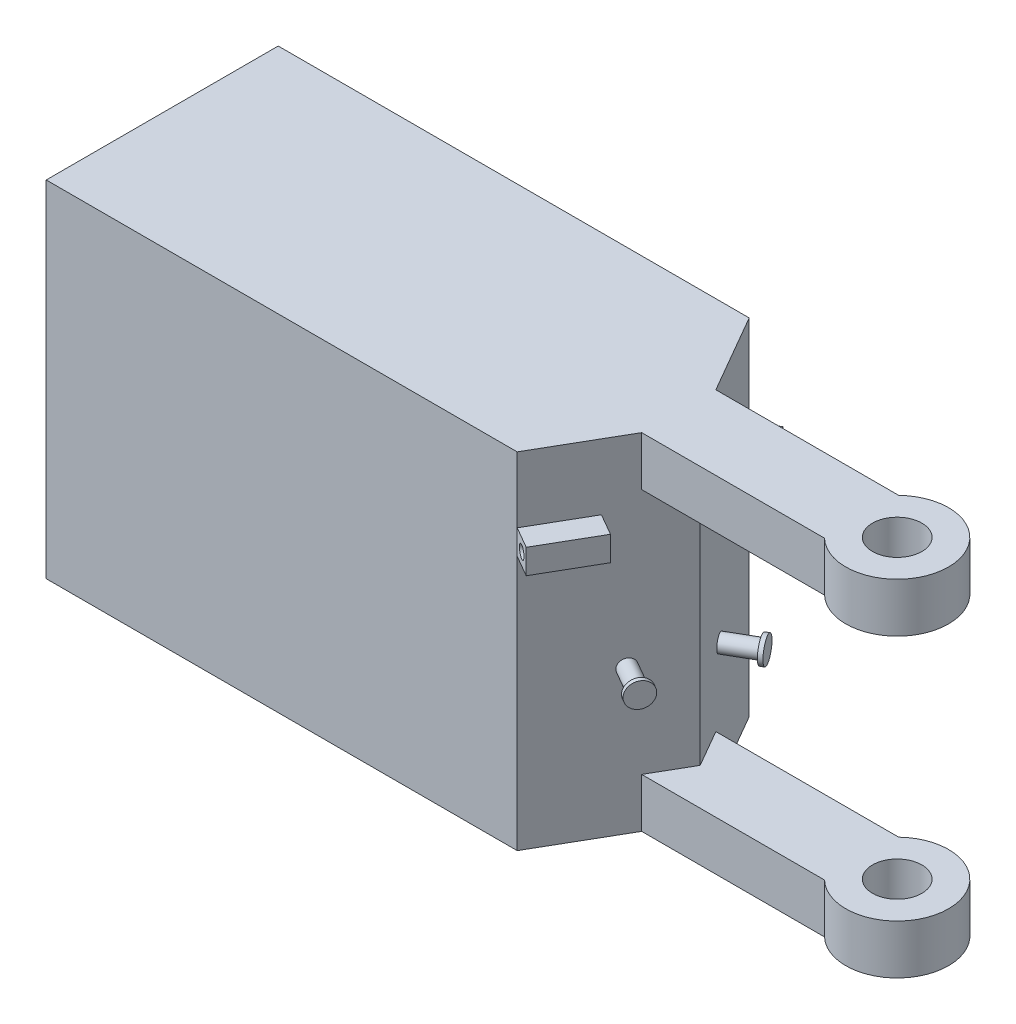
ISO-10303-21;
HEADER;
FILE_DESCRIPTION(('STEP AP214'),'2;1');
FILE_NAME('part.step','',(''),(''),'','','');
FILE_SCHEMA(('AUTOMOTIVE_DESIGN { 1 0 10303 214 1 1 1 1 }'));
ENDSEC;
DATA;
#1=APPLICATION_CONTEXT('core data for automotive mechanical design processes');
#2=APPLICATION_PROTOCOL_DEFINITION('international standard','automotive_design',2000,#1);
#3=PRODUCT_CONTEXT('',#1,'mechanical');
#4=PRODUCT('Part','Part','',(#3));
#5=PRODUCT_RELATED_PRODUCT_CATEGORY('part','',(#4));
#6=PRODUCT_DEFINITION_FORMATION('','',#4);
#7=PRODUCT_DEFINITION_CONTEXT('part definition',#1,'design');
#8=PRODUCT_DEFINITION('design','',#6,#7);
#9=PRODUCT_DEFINITION_SHAPE('','',#8);
#10=(LENGTH_UNIT() NAMED_UNIT(*) SI_UNIT(.MILLI.,.METRE.));
#11=(NAMED_UNIT(*) PLANE_ANGLE_UNIT() SI_UNIT($,.RADIAN.));
#12=(NAMED_UNIT(*) SI_UNIT($,.STERADIAN.) SOLID_ANGLE_UNIT());
#13=UNCERTAINTY_MEASURE_WITH_UNIT(LENGTH_MEASURE(1.E-05),#10,'distance_accuracy_value','');
#14=(GEOMETRIC_REPRESENTATION_CONTEXT(3) GLOBAL_UNCERTAINTY_ASSIGNED_CONTEXT((#13)) GLOBAL_UNIT_ASSIGNED_CONTEXT((#10,
#11,#12)) REPRESENTATION_CONTEXT('',''));
#15=CARTESIAN_POINT('',(0.,0.,0.));
#16=DIRECTION('',(0.,0.,1.));
#17=DIRECTION('',(1.,0.,0.));
#18=AXIS2_PLACEMENT_3D('',#15,#16,#17);
#19=CARTESIAN_POINT('',(131.699506883893,35.,15.5213300029047));
#20=DIRECTION('',(-0.86602540378444,0.,-0.499999999999998));
#21=DIRECTION('',(-0.499999999999997,0.,0.86602540378444));
#22=AXIS2_PLACEMENT_3D('',#19,#20,#21);
#23=CYLINDRICAL_SURFACE('',#22,2.);
#24=CARTESIAN_POINT('',(124.338290951725,35.,11.2713300029047));
#25=DIRECTION('',(-0.86602540378444,0.,-0.499999999999997));
#26=DIRECTION('',(-0.499999999999997,0.,0.86602540378444));
#27=AXIS2_PLACEMENT_3D('',#24,#25,#26);
#28=CIRCLE('',#27,2.);
#29=CARTESIAN_POINT('',(123.338290951725,35.,13.0033808104736));
#30=VERTEX_POINT('',#29);
#31=EDGE_CURVE('E296',#30,#30,#28,.F.);
#32=ORIENTED_EDGE('',*,*,#31,.T.);
#33=EDGE_LOOP('',(#32));
#34=FACE_BOUND('',#33,.T.);
#35=CARTESIAN_POINT('',(130.833481480108,35.,15.0213300029047));
#36=DIRECTION('',(0.86602540378444,0.,0.499999999999997));
#37=DIRECTION('',(0.499999999999997,0.,-0.86602540378444));
#38=AXIS2_PLACEMENT_3D('',#35,#36,#37);
#39=CIRCLE('',#38,2.);
#40=CARTESIAN_POINT('',(131.833481480108,35.,13.2892791953358));
#41=VERTEX_POINT('',#40);
#42=EDGE_CURVE('E11',#41,#41,#39,.T.);
#43=ORIENTED_EDGE('',*,*,#42,.F.);
#44=EDGE_LOOP('',(#43));
#45=FACE_BOUND('',#44,.T.);
#46=ADVANCED_FACE('F37',(#34,#45),#23,.T.);
#47=CARTESIAN_POINT('',(131.699506883893,29.,-15.5213300029046));
#48=DIRECTION('',(-0.86602540378444,0.,0.499999999999998));
#49=DIRECTION('',(0.499999999999997,0.,0.86602540378444));
#50=AXIS2_PLACEMENT_3D('',#47,#48,#49);
#51=CYLINDRICAL_SURFACE('',#50,2.);
#52=CARTESIAN_POINT('',(124.338290951725,29.,-11.2713300029047));
#53=DIRECTION('',(0.86602540378444,0.,-0.499999999999997));
#54=DIRECTION('',(-0.499999999999998,0.,-0.86602540378444));
#55=AXIS2_PLACEMENT_3D('',#52,#53,#54);
#56=CIRCLE('',#55,2.);
#57=CARTESIAN_POINT('',(123.338290951725,29.,-13.0033808104735));
#58=VERTEX_POINT('',#57);
#59=EDGE_CURVE('E237',#58,#58,#56,.T.);
#60=ORIENTED_EDGE('',*,*,#59,.T.);
#61=EDGE_LOOP('',(#60));
#62=FACE_BOUND('',#61,.T.);
#63=CARTESIAN_POINT('',(130.833481480108,29.,-15.0213300029047));
#64=DIRECTION('',(0.86602540378444,0.,-0.499999999999997));
#65=DIRECTION('',(-0.499999999999997,0.,-0.86602540378444));
#66=AXIS2_PLACEMENT_3D('',#63,#64,#65);
#67=CIRCLE('',#66,2.);
#68=CARTESIAN_POINT('',(129.833481480108,29.,-16.7533808104736));
#69=VERTEX_POINT('',#68);
#70=EDGE_CURVE('E45',#69,#69,#67,.T.);
#71=ORIENTED_EDGE('',*,*,#70,.F.);
#72=EDGE_LOOP('',(#71));
#73=FACE_BOUND('',#72,.T.);
#74=ADVANCED_FACE('F367',(#62,#73),#51,.T.);
#75=CARTESIAN_POINT('',(98.1343472722705,12.,56.6578918143932));
#76=DIRECTION('',(-0.86602540378444,0.,-0.499999999999997));
#77=DIRECTION('',(-0.499999999999997,0.,0.86602540378444));
#78=AXIS2_PLACEMENT_3D('',#75,#76,#77);
#79=PLANE('',#78);
#80=ORIENTED_EDGE('',*,*,#31,.F.);
#81=EDGE_LOOP('',(#80));
#82=FACE_BOUND('',#81,.T.);
#83=DIRECTION('',(0.499999999999998,0.,-0.86602540378444));
#84=VECTOR('',#83,1.);
#85=CARTESIAN_POINT('',(122.056109317579,62.,15.2241845453452));
#86=LINE('',#85,#84);
#87=CARTESIAN_POINT('',(114.556109317579,62.,28.2145656021117));
#88=VERTEX_POINT('',#87);
#89=CARTESIAN_POINT('',(122.056109317579,62.,15.2241845453452));
#90=VERTEX_POINT('',#89);
#91=EDGE_CURVE('E471',#88,#90,#86,.T.);
#92=ORIENTED_EDGE('',*,*,#91,.F.);
#93=DIRECTION('',(0.,-1.,0.));
#94=VECTOR('',#93,1.);
#95=CARTESIAN_POINT('',(114.556109317579,12.,28.2145656021117));
#96=LINE('',#95,#94);
#97=CARTESIAN_POINT('',(114.556109317579,0.,28.2145656021117));
#98=VERTEX_POINT('',#97);
#99=EDGE_CURVE('E343',#88,#98,#96,.T.);
#100=ORIENTED_EDGE('',*,*,#99,.T.);
#101=DIRECTION('',(0.499999999999997,0.,-0.86602540378444));
#102=VECTOR('',#101,1.);
#103=CARTESIAN_POINT('',(98.1343472722705,0.,56.6578918143932));
#104=LINE('',#103,#102);
#105=CARTESIAN_POINT('',(125.637290842341,0.,9.02139619333056));
#106=VERTEX_POINT('',#105);
#107=EDGE_CURVE('E337',#98,#106,#104,.T.);
#108=ORIENTED_EDGE('',*,*,#107,.T.);
#109=DIRECTION('',(0.,-1.,0.));
#110=VECTOR('',#109,1.);
#111=CARTESIAN_POINT('',(125.637290842341,12.,9.02139619333056));
#112=LINE('',#111,#110);
#113=CARTESIAN_POINT('',(125.637290842341,12.,9.02139619333056));
#114=VERTEX_POINT('',#113);
#115=EDGE_CURVE('E316',#114,#106,#112,.T.);
#116=ORIENTED_EDGE('',*,*,#115,.F.);
#117=DIRECTION('',(0.500000000000004,0.,-0.866025403784437));
#118=VECTOR('',#117,1.);
#119=CARTESIAN_POINT('',(130.845796363027,12.,2.72351585728359E-13));
#120=LINE('',#119,#118);
#121=CARTESIAN_POINT('',(130.845796363027,12.,2.72351585728359E-13));
#122=VERTEX_POINT('',#121);
#123=EDGE_CURVE('E293',#114,#122,#120,.T.);
#124=ORIENTED_EDGE('',*,*,#123,.T.);
#125=DIRECTION('',(0.,-1.,0.));
#126=VECTOR('',#125,1.);
#127=CARTESIAN_POINT('',(130.845796363027,42.,2.72351585728359E-13));
#128=LINE('',#127,#126);
#129=CARTESIAN_POINT('',(130.845796363027,72.,2.72351585728359E-13));
#130=VERTEX_POINT('',#129);
#131=EDGE_CURVE('E300',#130,#122,#128,.T.);
#132=ORIENTED_EDGE('',*,*,#131,.F.);
#133=DIRECTION('',(0.500000000000004,0.,-0.866025403784437));
#134=VECTOR('',#133,1.);
#135=CARTESIAN_POINT('',(130.845796363027,72.,2.72351585728359E-13));
#136=LINE('',#135,#134);
#137=CARTESIAN_POINT('',(125.637290842341,72.,9.02139619333056));
#138=VERTEX_POINT('',#137);
#139=EDGE_CURVE('E241',#138,#130,#136,.T.);
#140=ORIENTED_EDGE('',*,*,#139,.F.);
#141=DIRECTION('',(0.,1.,0.));
#142=VECTOR('',#141,1.);
#143=CARTESIAN_POINT('',(125.637290842341,72.,9.02139619333056));
#144=LINE('',#143,#142);
#145=CARTESIAN_POINT('',(125.637290842341,84.,9.02139619333056));
#146=VERTEX_POINT('',#145);
#147=EDGE_CURVE('E260',#138,#146,#144,.T.);
#148=ORIENTED_EDGE('',*,*,#147,.T.);
#149=DIRECTION('',(0.499999999999997,0.,-0.86602540378444));
#150=VECTOR('',#149,1.);
#151=CARTESIAN_POINT('',(98.1343472722705,84.,56.6578918143932));
#152=LINE('',#151,#150);
#153=CARTESIAN_POINT('',(114.556109317579,84.,28.2145656021117));
#154=VERTEX_POINT('',#153);
#155=EDGE_CURVE('E279',#154,#146,#152,.T.);
#156=ORIENTED_EDGE('',*,*,#155,.F.);
#157=CARTESIAN_POINT('',(114.556109317579,68.,28.2145656021118));
#158=VERTEX_POINT('',#157);
#159=EDGE_CURVE('E344',#154,#158,#96,.T.);
#160=ORIENTED_EDGE('',*,*,#159,.T.);
#161=DIRECTION('',(-0.499999999999998,0.,0.86602540378444));
#162=VECTOR('',#161,1.);
#163=CARTESIAN_POINT('',(114.556109317579,68.,28.2145656021118));
#164=LINE('',#163,#162);
#165=CARTESIAN_POINT('',(122.056109317579,68.,15.2241845453452));
#166=VERTEX_POINT('',#165);
#167=EDGE_CURVE('E57',#166,#158,#164,.T.);
#168=ORIENTED_EDGE('',*,*,#167,.F.);
#169=DIRECTION('',(0.,1.,0.));
#170=VECTOR('',#169,1.);
#171=CARTESIAN_POINT('',(122.056109317579,68.,15.2241845453452));
#172=LINE('',#171,#170);
#173=EDGE_CURVE('E52',#90,#166,#172,.T.);
#174=ORIENTED_EDGE('',*,*,#173,.F.);
#175=EDGE_LOOP('',(#92,#100,#108,#116,#124,#132,#140,#148,#156,#160,#168,#174));
#176=FACE_BOUND('',#175,.T.);
#177=ADVANCED_FACE('F369',(#82,#176),#79,.F.);
#178=CARTESIAN_POINT('',(98.1343472722705,12.,-56.6578918143932));
#179=DIRECTION('',(0.86602540378444,0.,-0.499999999999997));
#180=DIRECTION('',(-0.499999999999997,0.,-0.86602540378444));
#181=AXIS2_PLACEMENT_3D('',#178,#179,#180);
#182=PLANE('',#181);
#183=ORIENTED_EDGE('',*,*,#59,.F.);
#184=EDGE_LOOP('',(#183));
#185=FACE_BOUND('',#184,.T.);
#186=DIRECTION('',(0.,-1.,0.));
#187=VECTOR('',#186,1.);
#188=CARTESIAN_POINT('',(121.104357457631,56.1904414352187,-16.8726671229741));
#189=LINE('',#188,#187);
#190=CARTESIAN_POINT('',(121.104357457631,62.1904414352187,-16.8726671229741));
#191=VERTEX_POINT('',#190);
#192=CARTESIAN_POINT('',(121.104357457631,56.1904414352187,-16.8726671229741));
#193=VERTEX_POINT('',#192);
#194=EDGE_CURVE('E204',#191,#193,#189,.T.);
#195=ORIENTED_EDGE('',*,*,#194,.F.);
#196=DIRECTION('',(0.499999999999997,0.,0.86602540378444));
#197=VECTOR('',#196,1.);
#198=CARTESIAN_POINT('',(121.104357457631,62.1904414352187,-16.8726671229741));
#199=LINE('',#198,#197);
#200=CARTESIAN_POINT('',(114.556109317579,62.1904414352187,-28.2145656021118));
#201=VERTEX_POINT('',#200);
#202=EDGE_CURVE('E202',#201,#191,#199,.T.);
#203=ORIENTED_EDGE('',*,*,#202,.F.);
#204=DIRECTION('',(0.,-1.,0.));
#205=VECTOR('',#204,1.);
#206=CARTESIAN_POINT('',(114.556109317579,12.,-28.2145656021117));
#207=LINE('',#206,#205);
#208=CARTESIAN_POINT('',(114.556109317579,84.,-28.2145656021117));
#209=VERTEX_POINT('',#208);
#210=EDGE_CURVE('E351',#209,#201,#207,.T.);
#211=ORIENTED_EDGE('',*,*,#210,.F.);
#212=DIRECTION('',(0.499999999999997,0.,0.86602540378444));
#213=VECTOR('',#212,1.);
#214=CARTESIAN_POINT('',(98.1343472722705,84.,-56.6578918143932));
#215=LINE('',#214,#213);
#216=CARTESIAN_POINT('',(125.637290842341,84.,-9.02139619333056));
#217=VERTEX_POINT('',#216);
#218=EDGE_CURVE('E268',#209,#217,#215,.T.);
#219=ORIENTED_EDGE('',*,*,#218,.T.);
#220=DIRECTION('',(0.,1.,0.));
#221=VECTOR('',#220,1.);
#222=CARTESIAN_POINT('',(125.637290842341,72.,-9.02139619333056));
#223=LINE('',#222,#221);
#224=CARTESIAN_POINT('',(125.637290842341,72.,-9.02139619333056));
#225=VERTEX_POINT('',#224);
#226=EDGE_CURVE('E285',#225,#217,#223,.T.);
#227=ORIENTED_EDGE('',*,*,#226,.F.);
#228=DIRECTION('',(-0.499999999999997,0.,-0.86602540378444));
#229=VECTOR('',#228,1.);
#230=CARTESIAN_POINT('',(114.556109317579,72.,-28.2145656021117));
#231=LINE('',#230,#229);
#232=EDGE_CURVE('E240',#130,#225,#231,.T.);
#233=ORIENTED_EDGE('',*,*,#232,.F.);
#234=ORIENTED_EDGE('',*,*,#131,.T.);
#235=DIRECTION('',(-0.499999999999997,0.,-0.86602540378444));
#236=VECTOR('',#235,1.);
#237=CARTESIAN_POINT('',(114.556109317579,12.,-28.2145656021117));
#238=LINE('',#237,#236);
#239=CARTESIAN_POINT('',(125.637290842341,12.,-9.02139619333056));
#240=VERTEX_POINT('',#239);
#241=EDGE_CURVE('E244',#122,#240,#238,.T.);
#242=ORIENTED_EDGE('',*,*,#241,.T.);
#243=DIRECTION('',(0.,-1.,0.));
#244=VECTOR('',#243,1.);
#245=CARTESIAN_POINT('',(125.637290842341,12.,-9.02139619333056));
#246=LINE('',#245,#244);
#247=CARTESIAN_POINT('',(125.637290842341,0.,-9.02139619333056));
#248=VERTEX_POINT('',#247);
#249=EDGE_CURVE('E354',#240,#248,#246,.T.);
#250=ORIENTED_EDGE('',*,*,#249,.T.);
#251=DIRECTION('',(0.499999999999997,0.,0.86602540378444));
#252=VECTOR('',#251,1.);
#253=CARTESIAN_POINT('',(98.1343472722705,0.,-56.6578918143932));
#254=LINE('',#253,#252);
#255=CARTESIAN_POINT('',(114.556109317579,0.,-28.2145656021117));
#256=VERTEX_POINT('',#255);
#257=EDGE_CURVE('E325',#256,#248,#254,.T.);
#258=ORIENTED_EDGE('',*,*,#257,.F.);
#259=CARTESIAN_POINT('',(114.556109317579,56.1904414352186,-28.2145656021117));
#260=VERTEX_POINT('',#259);
#261=EDGE_CURVE('E350',#260,#256,#207,.T.);
#262=ORIENTED_EDGE('',*,*,#261,.F.);
#263=DIRECTION('',(-0.499999999999997,0.,-0.86602540378444));
#264=VECTOR('',#263,1.);
#265=CARTESIAN_POINT('',(114.556109317579,56.1904414352187,-28.2145656021118));
#266=LINE('',#265,#264);
#267=EDGE_CURVE('E223',#193,#260,#266,.T.);
#268=ORIENTED_EDGE('',*,*,#267,.F.);
#269=EDGE_LOOP('',(#195,#203,#211,#219,#227,#233,#234,#242,#250,#258,#262,#268));
#270=FACE_BOUND('',#269,.T.);
#271=ADVANCED_FACE('F376',(#185,#270),#182,.T.);
#272=CARTESIAN_POINT('',(0.,12.,9.02139619333056));
#273=DIRECTION('',(0.,0.,-1.));
#274=DIRECTION('',(-1.,0.,0.));
#275=AXIS2_PLACEMENT_3D('',#272,#273,#274);
#276=PLANE('',#275);
#277=DIRECTION('',(1.,0.,0.));
#278=VECTOR('',#277,1.);
#279=CARTESIAN_POINT('',(0.,0.,9.02139619333056));
#280=LINE('',#279,#278);
#281=CARTESIAN_POINT('',(170.113446459772,0.,9.02139619333057));
#282=VERTEX_POINT('',#281);
#283=EDGE_CURVE('E303',#106,#282,#280,.T.);
#284=ORIENTED_EDGE('',*,*,#283,.T.);
#285=DIRECTION('',(0.,-1.,0.));
#286=VECTOR('',#285,1.);
#287=CARTESIAN_POINT('',(170.113446459772,12.,9.02139619333057));
#288=LINE('',#287,#286);
#289=CARTESIAN_POINT('',(170.113446459772,12.,9.02139619333057));
#290=VERTEX_POINT('',#289);
#291=EDGE_CURVE('E297',#290,#282,#288,.T.);
#292=ORIENTED_EDGE('',*,*,#291,.F.);
#293=DIRECTION('',(1.,0.,0.));
#294=VECTOR('',#293,1.);
#295=CARTESIAN_POINT('',(0.,12.,9.02139619333056));
#296=LINE('',#295,#294);
#297=EDGE_CURVE('E304',#114,#290,#296,.T.);
#298=ORIENTED_EDGE('',*,*,#297,.F.);
#299=ORIENTED_EDGE('',*,*,#115,.T.);
#300=EDGE_LOOP('',(#284,#292,#298,#299));
#301=FACE_BOUND('',#300,.T.);
#302=ADVANCED_FACE('F39',(#301),#276,.F.);
#303=CARTESIAN_POINT('',(178.765868705766,12.,0.));
#304=DIRECTION('',(0.,-1.,0.));
#305=DIRECTION('',(0.,0.,-1.));
#306=AXIS2_PLACEMENT_3D('',#303,#304,#305);
#307=CYLINDRICAL_SURFACE('',#306,12.5);
#308=CARTESIAN_POINT('',(178.765868705766,0.,0.));
#309=DIRECTION('',(0.,1.,0.));
#310=DIRECTION('',(0.,0.,1.));
#311=AXIS2_PLACEMENT_3D('',#308,#309,#310);
#312=CIRCLE('',#311,12.5);
#313=CARTESIAN_POINT('',(170.113446459772,0.,-9.02139619333057));
#314=VERTEX_POINT('',#313);
#315=EDGE_CURVE('E319',#282,#314,#312,.T.);
#316=ORIENTED_EDGE('',*,*,#315,.T.);
#317=DIRECTION('',(0.,-1.,0.));
#318=VECTOR('',#317,1.);
#319=CARTESIAN_POINT('',(170.113446459772,12.,-9.02139619333057));
#320=LINE('',#319,#318);
#321=CARTESIAN_POINT('',(170.113446459772,12.,-9.02139619333057));
#322=VERTEX_POINT('',#321);
#323=EDGE_CURVE('E356',#322,#314,#320,.T.);
#324=ORIENTED_EDGE('',*,*,#323,.F.);
#325=CARTESIAN_POINT('',(178.765868705766,12.,0.));
#326=DIRECTION('',(0.,1.,0.));
#327=DIRECTION('',(0.,0.,1.));
#328=AXIS2_PLACEMENT_3D('',#325,#326,#327);
#329=CIRCLE('',#328,12.5);
#330=EDGE_CURVE('E307',#290,#322,#329,.T.);
#331=ORIENTED_EDGE('',*,*,#330,.F.);
#332=ORIENTED_EDGE('',*,*,#291,.T.);
#333=EDGE_LOOP('',(#316,#324,#331,#332));
#334=FACE_BOUND('',#333,.T.);
#335=ADVANCED_FACE('F438',(#334),#307,.T.);
#336=CARTESIAN_POINT('',(0.,12.,-9.02139619333056));
#337=DIRECTION('',(0.,0.,-1.));
#338=DIRECTION('',(-1.,0.,0.));
#339=AXIS2_PLACEMENT_3D('',#336,#337,#338);
#340=PLANE('',#339);
#341=DIRECTION('',(1.,0.,0.));
#342=VECTOR('',#341,1.);
#343=CARTESIAN_POINT('',(0.,0.,-9.02139619333056));
#344=LINE('',#343,#342);
#345=EDGE_CURVE('E322',#248,#314,#344,.T.);
#346=ORIENTED_EDGE('',*,*,#345,.F.);
#347=ORIENTED_EDGE('',*,*,#249,.F.);
#348=DIRECTION('',(1.,0.,0.));
#349=VECTOR('',#348,1.);
#350=CARTESIAN_POINT('',(0.,12.,-9.02139619333056));
#351=LINE('',#350,#349);
#352=EDGE_CURVE('E310',#240,#322,#351,.T.);
#353=ORIENTED_EDGE('',*,*,#352,.T.);
#354=ORIENTED_EDGE('',*,*,#323,.T.);
#355=EDGE_LOOP('',(#346,#347,#353,#354));
#356=FACE_BOUND('',#355,.T.);
#357=ADVANCED_FACE('F432',(#356),#340,.T.);
#358=CARTESIAN_POINT('',(0.,12.,-28.2145656021118));
#359=DIRECTION('',(0.,0.,-1.));
#360=DIRECTION('',(-1.,0.,0.));
#361=AXIS2_PLACEMENT_3D('',#358,#359,#360);
#362=PLANE('',#361);
#363=DIRECTION('',(1.,0.,0.));
#364=VECTOR('',#363,1.);
#365=CARTESIAN_POINT('',(0.,0.,-28.2145656021118));
#366=LINE('',#365,#364);
#367=CARTESIAN_POINT('',(0.,0.,-28.2145656021118));
#368=VERTEX_POINT('',#367);
#369=EDGE_CURVE('E328',#368,#256,#366,.T.);
#370=ORIENTED_EDGE('',*,*,#369,.F.);
#371=DIRECTION('',(0.,-1.,0.));
#372=VECTOR('',#371,1.);
#373=CARTESIAN_POINT('',(0.,12.,-28.2145656021118));
#374=LINE('',#373,#372);
#375=CARTESIAN_POINT('',(0.,84.,-28.2145656021118));
#376=VERTEX_POINT('',#375);
#377=EDGE_CURVE('E348',#376,#368,#374,.T.);
#378=ORIENTED_EDGE('',*,*,#377,.F.);
#379=DIRECTION('',(1.,0.,0.));
#380=VECTOR('',#379,1.);
#381=CARTESIAN_POINT('',(0.,84.,-28.2145656021118));
#382=LINE('',#381,#380);
#383=EDGE_CURVE('E270',#376,#209,#382,.T.);
#384=ORIENTED_EDGE('',*,*,#383,.T.);
#385=ORIENTED_EDGE('',*,*,#210,.T.);
#386=DIRECTION('',(0.,1.,0.));
#387=VECTOR('',#386,1.);
#388=CARTESIAN_POINT('',(114.556109317579,59.,-28.2145656021118));
#389=LINE('',#388,#387);
#390=EDGE_CURVE('E214',#260,#201,#389,.T.);
#391=ORIENTED_EDGE('',*,*,#390,.F.);
#392=ORIENTED_EDGE('',*,*,#261,.T.);
#393=EDGE_LOOP('',(#370,#378,#384,#385,#391,#392));
#394=FACE_BOUND('',#393,.T.);
#395=ADVANCED_FACE('F428',(#394),#362,.T.);
#396=CARTESIAN_POINT('',(0.,12.,0.));
#397=DIRECTION('',(-1.,0.,0.));
#398=DIRECTION('',(0.,0.,1.));
#399=AXIS2_PLACEMENT_3D('',#396,#397,#398);
#400=PLANE('',#399);
#401=DIRECTION('',(0.,0.,-1.));
#402=VECTOR('',#401,1.);
#403=CARTESIAN_POINT('',(0.,0.,0.));
#404=LINE('',#403,#402);
#405=CARTESIAN_POINT('',(0.,0.,28.2145656021118));
#406=VERTEX_POINT('',#405);
#407=EDGE_CURVE('E331',#406,#368,#404,.T.);
#408=ORIENTED_EDGE('',*,*,#407,.F.);
#409=DIRECTION('',(0.,-1.,0.));
#410=VECTOR('',#409,1.);
#411=CARTESIAN_POINT('',(0.,12.,28.2145656021118));
#412=LINE('',#411,#410);
#413=CARTESIAN_POINT('',(0.,84.,28.2145656021118));
#414=VERTEX_POINT('',#413);
#415=EDGE_CURVE('E346',#414,#406,#412,.T.);
#416=ORIENTED_EDGE('',*,*,#415,.F.);
#417=DIRECTION('',(0.,0.,-1.));
#418=VECTOR('',#417,1.);
#419=CARTESIAN_POINT('',(0.,84.,0.));
#420=LINE('',#419,#418);
#421=EDGE_CURVE('E273',#414,#376,#420,.T.);
#422=ORIENTED_EDGE('',*,*,#421,.T.);
#423=ORIENTED_EDGE('',*,*,#377,.T.);
#424=EDGE_LOOP('',(#408,#416,#422,#423));
#425=FACE_BOUND('',#424,.T.);
#426=ADVANCED_FACE('F424',(#425),#400,.T.);
#427=CARTESIAN_POINT('',(0.,12.,28.2145656021118));
#428=DIRECTION('',(0.,0.,-1.));
#429=DIRECTION('',(-1.,0.,0.));
#430=AXIS2_PLACEMENT_3D('',#427,#428,#429);
#431=PLANE('',#430);
#432=DIRECTION('',(1.,0.,0.));
#433=VECTOR('',#432,1.);
#434=CARTESIAN_POINT('',(0.,0.,28.2145656021118));
#435=LINE('',#434,#433);
#436=EDGE_CURVE('E334',#406,#98,#435,.T.);
#437=ORIENTED_EDGE('',*,*,#436,.T.);
#438=ORIENTED_EDGE('',*,*,#99,.F.);
#439=DIRECTION('',(0.,-1.,0.));
#440=VECTOR('',#439,1.);
#441=CARTESIAN_POINT('',(114.556109317579,68.,28.2145656021118));
#442=LINE('',#441,#440);
#443=EDGE_CURVE('E201',#158,#88,#442,.T.);
#444=ORIENTED_EDGE('',*,*,#443,.F.);
#445=ORIENTED_EDGE('',*,*,#159,.F.);
#446=DIRECTION('',(1.,0.,0.));
#447=VECTOR('',#446,1.);
#448=CARTESIAN_POINT('',(0.,84.,28.2145656021118));
#449=LINE('',#448,#447);
#450=EDGE_CURVE('E276',#414,#154,#449,.T.);
#451=ORIENTED_EDGE('',*,*,#450,.F.);
#452=ORIENTED_EDGE('',*,*,#415,.T.);
#453=EDGE_LOOP('',(#437,#438,#444,#445,#451,#452));
#454=FACE_BOUND('',#453,.T.);
#455=ADVANCED_FACE('F419',(#454),#431,.F.);
#456=CARTESIAN_POINT('',(178.765868705766,12.,0.));
#457=DIRECTION('',(0.,-1.,0.));
#458=DIRECTION('',(0.,0.,-1.));
#459=AXIS2_PLACEMENT_3D('',#456,#457,#458);
#460=CYLINDRICAL_SURFACE('',#459,6.00000000000002);
#461=CARTESIAN_POINT('',(178.765868705766,12.,0.));
#462=DIRECTION('',(0.,1.,0.));
#463=DIRECTION('',(0.,0.,1.));
#464=AXIS2_PLACEMENT_3D('',#461,#462,#463);
#465=CIRCLE('',#464,6.00000000000002);
#466=CARTESIAN_POINT('',(178.765868705766,12.,6.00000000000002));
#467=VERTEX_POINT('',#466);
#468=EDGE_CURVE('E313',#467,#467,#465,.T.);
#469=ORIENTED_EDGE('',*,*,#468,.T.);
#470=EDGE_LOOP('',(#469));
#471=FACE_BOUND('',#470,.T.);
#472=CARTESIAN_POINT('',(178.765868705766,0.,0.));
#473=DIRECTION('',(0.,1.,0.));
#474=DIRECTION('',(0.,0.,1.));
#475=AXIS2_PLACEMENT_3D('',#472,#473,#474);
#476=CIRCLE('',#475,6.00000000000002);
#477=CARTESIAN_POINT('',(178.765868705766,0.,6.00000000000002));
#478=VERTEX_POINT('',#477);
#479=EDGE_CURVE('E308',#478,#478,#476,.T.);
#480=ORIENTED_EDGE('',*,*,#479,.F.);
#481=EDGE_LOOP('',(#480));
#482=FACE_BOUND('',#481,.T.);
#483=ADVANCED_FACE('F413',(#471,#482),#460,.F.);
#484=CARTESIAN_POINT('',(0.,12.,0.));
#485=DIRECTION('',(0.,1.,0.));
#486=DIRECTION('',(0.,0.,1.));
#487=AXIS2_PLACEMENT_3D('',#484,#485,#486);
#488=PLANE('',#487);
#489=ORIENTED_EDGE('',*,*,#241,.F.);
#490=ORIENTED_EDGE('',*,*,#123,.F.);
#491=ORIENTED_EDGE('',*,*,#297,.T.);
#492=ORIENTED_EDGE('',*,*,#330,.T.);
#493=ORIENTED_EDGE('',*,*,#352,.F.);
#494=EDGE_LOOP('',(#489,#490,#491,#492,#493));
#495=FACE_BOUND('',#494,.T.);
#496=ORIENTED_EDGE('',*,*,#468,.F.);
#497=EDGE_LOOP('',(#496));
#498=FACE_BOUND('',#497,.T.);
#499=ADVANCED_FACE('F410',(#495,#498),#488,.T.);
#500=CARTESIAN_POINT('',(0.,0.,0.));
#501=DIRECTION('',(0.,1.,0.));
#502=DIRECTION('',(0.,0.,1.));
#503=AXIS2_PLACEMENT_3D('',#500,#501,#502);
#504=PLANE('',#503);
#505=ORIENTED_EDGE('',*,*,#283,.F.);
#506=ORIENTED_EDGE('',*,*,#107,.F.);
#507=ORIENTED_EDGE('',*,*,#436,.F.);
#508=ORIENTED_EDGE('',*,*,#407,.T.);
#509=ORIENTED_EDGE('',*,*,#369,.T.);
#510=ORIENTED_EDGE('',*,*,#257,.T.);
#511=ORIENTED_EDGE('',*,*,#345,.T.);
#512=ORIENTED_EDGE('',*,*,#315,.F.);
#513=EDGE_LOOP('',(#505,#506,#507,#508,#509,#510,#511,#512));
#514=FACE_BOUND('',#513,.T.);
#515=ORIENTED_EDGE('',*,*,#479,.T.);
#516=EDGE_LOOP('',(#515));
#517=FACE_BOUND('',#516,.T.);
#518=ADVANCED_FACE('F408',(#514,#517),#504,.F.);
#519=CARTESIAN_POINT('',(0.,72.,9.02139619333056));
#520=DIRECTION('',(0.,0.,-1.));
#521=DIRECTION('',(-1.,0.,0.));
#522=AXIS2_PLACEMENT_3D('',#519,#520,#521);
#523=PLANE('',#522);
#524=DIRECTION('',(1.,0.,0.));
#525=VECTOR('',#524,1.);
#526=CARTESIAN_POINT('',(0.,84.,9.02139619333056));
#527=LINE('',#526,#525);
#528=CARTESIAN_POINT('',(170.113446459772,84.,9.02139619333057));
#529=VERTEX_POINT('',#528);
#530=EDGE_CURVE('E247',#146,#529,#527,.T.);
#531=ORIENTED_EDGE('',*,*,#530,.F.);
#532=ORIENTED_EDGE('',*,*,#147,.F.);
#533=DIRECTION('',(1.,0.,0.));
#534=VECTOR('',#533,1.);
#535=CARTESIAN_POINT('',(0.,72.,9.02139619333056));
#536=LINE('',#535,#534);
#537=CARTESIAN_POINT('',(170.113446459772,72.,9.02139619333057));
#538=VERTEX_POINT('',#537);
#539=EDGE_CURVE('E248',#138,#538,#536,.T.);
#540=ORIENTED_EDGE('',*,*,#539,.T.);
#541=DIRECTION('',(0.,1.,0.));
#542=VECTOR('',#541,1.);
#543=CARTESIAN_POINT('',(170.113446459772,72.,9.02139619333057));
#544=LINE('',#543,#542);
#545=EDGE_CURVE('E245',#538,#529,#544,.T.);
#546=ORIENTED_EDGE('',*,*,#545,.T.);
#547=EDGE_LOOP('',(#531,#532,#540,#546));
#548=FACE_BOUND('',#547,.T.);
#549=ADVANCED_FACE('F404',(#548),#523,.F.);
#550=CARTESIAN_POINT('',(178.765868705766,72.,0.));
#551=DIRECTION('',(0.,1.,0.));
#552=DIRECTION('',(0.,0.,-1.));
#553=AXIS2_PLACEMENT_3D('',#550,#551,#552);
#554=CYLINDRICAL_SURFACE('',#553,12.5);
#555=CARTESIAN_POINT('',(178.765868705766,84.,0.));
#556=DIRECTION('',(0.,1.,0.));
#557=DIRECTION('',(0.,0.,1.));
#558=AXIS2_PLACEMENT_3D('',#555,#556,#557);
#559=CIRCLE('',#558,12.5);
#560=CARTESIAN_POINT('',(170.113446459772,84.,-9.02139619333057));
#561=VERTEX_POINT('',#560);
#562=EDGE_CURVE('E263',#529,#561,#559,.T.);
#563=ORIENTED_EDGE('',*,*,#562,.F.);
#564=ORIENTED_EDGE('',*,*,#545,.F.);
#565=CARTESIAN_POINT('',(178.765868705766,72.,0.));
#566=DIRECTION('',(0.,1.,0.));
#567=DIRECTION('',(0.,0.,1.));
#568=AXIS2_PLACEMENT_3D('',#565,#566,#567);
#569=CIRCLE('',#568,12.5);
#570=CARTESIAN_POINT('',(170.113446459772,72.,-9.02139619333057));
#571=VERTEX_POINT('',#570);
#572=EDGE_CURVE('E251',#538,#571,#569,.T.);
#573=ORIENTED_EDGE('',*,*,#572,.T.);
#574=DIRECTION('',(0.,1.,0.));
#575=VECTOR('',#574,1.);
#576=CARTESIAN_POINT('',(170.113446459772,72.,-9.02139619333057));
#577=LINE('',#576,#575);
#578=EDGE_CURVE('E288',#571,#561,#577,.T.);
#579=ORIENTED_EDGE('',*,*,#578,.T.);
#580=EDGE_LOOP('',(#563,#564,#573,#579));
#581=FACE_BOUND('',#580,.T.);
#582=ADVANCED_FACE('F400',(#581),#554,.T.);
#583=CARTESIAN_POINT('',(0.,72.,-9.02139619333056));
#584=DIRECTION('',(0.,0.,-1.));
#585=DIRECTION('',(-1.,0.,0.));
#586=AXIS2_PLACEMENT_3D('',#583,#584,#585);
#587=PLANE('',#586);
#588=DIRECTION('',(1.,0.,0.));
#589=VECTOR('',#588,1.);
#590=CARTESIAN_POINT('',(0.,84.,-9.02139619333056));
#591=LINE('',#590,#589);
#592=EDGE_CURVE('E266',#217,#561,#591,.T.);
#593=ORIENTED_EDGE('',*,*,#592,.T.);
#594=ORIENTED_EDGE('',*,*,#578,.F.);
#595=DIRECTION('',(1.,0.,0.));
#596=VECTOR('',#595,1.);
#597=CARTESIAN_POINT('',(0.,72.,-9.02139619333056));
#598=LINE('',#597,#596);
#599=EDGE_CURVE('E255',#225,#571,#598,.T.);
#600=ORIENTED_EDGE('',*,*,#599,.F.);
#601=ORIENTED_EDGE('',*,*,#226,.T.);
#602=EDGE_LOOP('',(#593,#594,#600,#601));
#603=FACE_BOUND('',#602,.T.);
#604=ADVANCED_FACE('F396',(#603),#587,.T.);
#605=CARTESIAN_POINT('',(178.765868705766,72.,0.));
#606=DIRECTION('',(0.,1.,0.));
#607=DIRECTION('',(0.,0.,-1.));
#608=AXIS2_PLACEMENT_3D('',#605,#606,#607);
#609=CYLINDRICAL_SURFACE('',#608,6.00000000000002);
#610=CARTESIAN_POINT('',(178.765868705766,72.,0.));
#611=DIRECTION('',(0.,1.,0.));
#612=DIRECTION('',(0.,0.,1.));
#613=AXIS2_PLACEMENT_3D('',#610,#611,#612);
#614=CIRCLE('',#613,6.00000000000002);
#615=CARTESIAN_POINT('',(178.765868705766,72.,6.00000000000002));
#616=VERTEX_POINT('',#615);
#617=EDGE_CURVE('E257',#616,#616,#614,.T.);
#618=ORIENTED_EDGE('',*,*,#617,.F.);
#619=EDGE_LOOP('',(#618));
#620=FACE_BOUND('',#619,.T.);
#621=CARTESIAN_POINT('',(178.765868705766,84.,0.));
#622=DIRECTION('',(0.,1.,0.));
#623=DIRECTION('',(0.,0.,1.));
#624=AXIS2_PLACEMENT_3D('',#621,#622,#623);
#625=CIRCLE('',#624,6.00000000000002);
#626=CARTESIAN_POINT('',(178.765868705766,84.,6.00000000000002));
#627=VERTEX_POINT('',#626);
#628=EDGE_CURVE('E252',#627,#627,#625,.T.);
#629=ORIENTED_EDGE('',*,*,#628,.T.);
#630=EDGE_LOOP('',(#629));
#631=FACE_BOUND('',#630,.T.);
#632=ADVANCED_FACE('F388',(#620,#631),#609,.F.);
#633=CARTESIAN_POINT('',(0.,72.,0.));
#634=DIRECTION('',(0.,-1.,0.));
#635=DIRECTION('',(0.,0.,1.));
#636=AXIS2_PLACEMENT_3D('',#633,#634,#635);
#637=PLANE('',#636);
#638=ORIENTED_EDGE('',*,*,#232,.T.);
#639=ORIENTED_EDGE('',*,*,#599,.T.);
#640=ORIENTED_EDGE('',*,*,#572,.F.);
#641=ORIENTED_EDGE('',*,*,#539,.F.);
#642=ORIENTED_EDGE('',*,*,#139,.T.);
#643=EDGE_LOOP('',(#638,#639,#640,#641,#642));
#644=FACE_BOUND('',#643,.T.);
#645=ORIENTED_EDGE('',*,*,#617,.T.);
#646=EDGE_LOOP('',(#645));
#647=FACE_BOUND('',#646,.T.);
#648=ADVANCED_FACE('F384',(#644,#647),#637,.T.);
#649=CARTESIAN_POINT('',(0.,84.,0.));
#650=DIRECTION('',(0.,-1.,0.));
#651=DIRECTION('',(0.,0.,1.));
#652=AXIS2_PLACEMENT_3D('',#649,#650,#651);
#653=PLANE('',#652);
#654=ORIENTED_EDGE('',*,*,#530,.T.);
#655=ORIENTED_EDGE('',*,*,#562,.T.);
#656=ORIENTED_EDGE('',*,*,#592,.F.);
#657=ORIENTED_EDGE('',*,*,#218,.F.);
#658=ORIENTED_EDGE('',*,*,#383,.F.);
#659=ORIENTED_EDGE('',*,*,#421,.F.);
#660=ORIENTED_EDGE('',*,*,#450,.T.);
#661=ORIENTED_EDGE('',*,*,#155,.T.);
#662=EDGE_LOOP('',(#654,#655,#656,#657,#658,#659,#660,#661));
#663=FACE_BOUND('',#662,.T.);
#664=ORIENTED_EDGE('',*,*,#628,.F.);
#665=EDGE_LOOP('',(#664));
#666=FACE_BOUND('',#665,.T.);
#667=ADVANCED_FACE('F387',(#663,#666),#653,.F.);
#668=CARTESIAN_POINT('',(126.300509880338,62.1904414352187,-19.8726671229741));
#669=DIRECTION('',(0.,-1.,0.));
#670=DIRECTION('',(0.,0.,-1.));
#671=AXIS2_PLACEMENT_3D('',#668,#669,#670);
#672=PLANE('',#671);
#673=ORIENTED_EDGE('',*,*,#202,.T.);
#674=DIRECTION('',(-0.86602540378444,0.,0.499999999999998));
#675=VECTOR('',#674,1.);
#676=CARTESIAN_POINT('',(126.300509880338,62.1904414352187,-19.8726671229741));
#677=LINE('',#676,#675);
#678=CARTESIAN_POINT('',(126.300509880338,62.1904414352187,-19.8726671229741));
#679=VERTEX_POINT('',#678);
#680=EDGE_CURVE('E231',#679,#191,#677,.T.);
#681=ORIENTED_EDGE('',*,*,#680,.F.);
#682=DIRECTION('',(0.499999999999997,0.,0.86602540378444));
#683=VECTOR('',#682,1.);
#684=CARTESIAN_POINT('',(126.300509880338,62.1904414352187,-19.8726671229741));
#685=LINE('',#684,#683);
#686=CARTESIAN_POINT('',(119.752261740286,62.1904414352187,-31.2145656021118));
#687=VERTEX_POINT('',#686);
#688=EDGE_CURVE('E213',#687,#679,#685,.T.);
#689=ORIENTED_EDGE('',*,*,#688,.F.);
#690=DIRECTION('',(-0.86602540378444,0.,0.499999999999998));
#691=VECTOR('',#690,1.);
#692=CARTESIAN_POINT('',(119.752261740286,62.1904414352187,-31.2145656021118));
#693=LINE('',#692,#691);
#694=EDGE_CURVE('E234',#687,#201,#693,.T.);
#695=ORIENTED_EDGE('',*,*,#694,.T.);
#696=EDGE_LOOP('',(#673,#681,#689,#695));
#697=FACE_BOUND('',#696,.T.);
#698=ADVANCED_FACE('F392',(#697),#672,.F.);
#699=CARTESIAN_POINT('',(126.300509880338,56.1904414352187,-19.8726671229741));
#700=DIRECTION('',(-0.499999999999998,0.,-0.86602540378444));
#701=DIRECTION('',(-0.86602540378444,0.,0.499999999999998));
#702=AXIS2_PLACEMENT_3D('',#699,#700,#701);
#703=PLANE('',#702);
#704=CARTESIAN_POINT('',(124.568459072769,59.1904414352187,-18.8726671229741));
#705=DIRECTION('',(-0.499999999999998,0.,-0.86602540378444));
#706=DIRECTION('',(-0.86602540378444,0.,0.499999999999998));
#707=AXIS2_PLACEMENT_3D('',#704,#705,#706);
#708=CIRCLE('',#707,1.25000000000001);
#709=CARTESIAN_POINT('',(123.485927318038,59.1904414352187,-18.2476671229741));
#710=VERTEX_POINT('',#709);
#711=EDGE_CURVE('E495',#710,#710,#708,.T.);
#712=ORIENTED_EDGE('',*,*,#711,.T.);
#713=EDGE_LOOP('',(#712));
#714=FACE_BOUND('',#713,.T.);
#715=ORIENTED_EDGE('',*,*,#194,.T.);
#716=DIRECTION('',(-0.86602540378444,0.,0.499999999999998));
#717=VECTOR('',#716,1.);
#718=CARTESIAN_POINT('',(126.300509880338,56.1904414352187,-19.8726671229741));
#719=LINE('',#718,#717);
#720=CARTESIAN_POINT('',(126.300509880338,56.1904414352187,-19.8726671229741));
#721=VERTEX_POINT('',#720);
#722=EDGE_CURVE('E228',#721,#193,#719,.T.);
#723=ORIENTED_EDGE('',*,*,#722,.F.);
#724=DIRECTION('',(0.,-1.,0.));
#725=VECTOR('',#724,1.);
#726=CARTESIAN_POINT('',(126.300509880338,56.1904414352187,-19.8726671229741));
#727=LINE('',#726,#725);
#728=EDGE_CURVE('E216',#679,#721,#727,.T.);
#729=ORIENTED_EDGE('',*,*,#728,.F.);
#730=ORIENTED_EDGE('',*,*,#680,.T.);
#731=EDGE_LOOP('',(#715,#723,#729,#730));
#732=FACE_BOUND('',#731,.T.);
#733=ADVANCED_FACE('F539',(#714,#732),#703,.F.);
#734=CARTESIAN_POINT('',(119.752261740286,56.1904414352187,-31.2145656021118));
#735=DIRECTION('',(0.,1.,0.));
#736=DIRECTION('',(0.,0.,1.));
#737=AXIS2_PLACEMENT_3D('',#734,#735,#736);
#738=PLANE('',#737);
#739=ORIENTED_EDGE('',*,*,#267,.T.);
#740=DIRECTION('',(-0.86602540378444,0.,0.499999999999998));
#741=VECTOR('',#740,1.);
#742=CARTESIAN_POINT('',(119.752261740286,56.1904414352187,-31.2145656021118));
#743=LINE('',#742,#741);
#744=CARTESIAN_POINT('',(119.752261740286,56.1904414352187,-31.2145656021118));
#745=VERTEX_POINT('',#744);
#746=EDGE_CURVE('E220',#745,#260,#743,.T.);
#747=ORIENTED_EDGE('',*,*,#746,.F.);
#748=DIRECTION('',(-0.499999999999997,0.,-0.86602540378444));
#749=VECTOR('',#748,1.);
#750=CARTESIAN_POINT('',(119.752261740286,56.1904414352187,-31.2145656021118));
#751=LINE('',#750,#749);
#752=EDGE_CURVE('E218',#721,#745,#751,.T.);
#753=ORIENTED_EDGE('',*,*,#752,.F.);
#754=ORIENTED_EDGE('',*,*,#722,.T.);
#755=EDGE_LOOP('',(#739,#747,#753,#754));
#756=FACE_BOUND('',#755,.T.);
#757=ADVANCED_FACE('F535',(#756),#738,.F.);
#758=CARTESIAN_POINT('',(119.752261740286,59.,-31.2145656021118));
#759=DIRECTION('',(0.499999999999998,0.,0.86602540378444));
#760=DIRECTION('',(0.86602540378444,0.,-0.499999999999998));
#761=AXIS2_PLACEMENT_3D('',#758,#759,#760);
#762=PLANE('',#761);
#763=CARTESIAN_POINT('',(118.020210932717,59.1904414352187,-30.2145656021118));
#764=DIRECTION('',(-0.499999999999998,0.,-0.86602540378444));
#765=DIRECTION('',(-0.86602540378444,0.,0.499999999999998));
#766=AXIS2_PLACEMENT_3D('',#763,#764,#765);
#767=CIRCLE('',#766,1.25000000000001);
#768=CARTESIAN_POINT('',(116.937679177987,59.1904414352187,-29.5895656021118));
#769=VERTEX_POINT('',#768);
#770=EDGE_CURVE('E500',#769,#769,#767,.T.);
#771=ORIENTED_EDGE('',*,*,#770,.F.);
#772=EDGE_LOOP('',(#771));
#773=FACE_BOUND('',#772,.T.);
#774=ORIENTED_EDGE('',*,*,#390,.T.);
#775=ORIENTED_EDGE('',*,*,#694,.F.);
#776=DIRECTION('',(0.,1.,0.));
#777=VECTOR('',#776,1.);
#778=CARTESIAN_POINT('',(119.752261740286,62.1904414352187,-31.2145656021118));
#779=LINE('',#778,#777);
#780=EDGE_CURVE('E210',#745,#687,#779,.T.);
#781=ORIENTED_EDGE('',*,*,#780,.F.);
#782=ORIENTED_EDGE('',*,*,#746,.T.);
#783=EDGE_LOOP('',(#774,#775,#781,#782));
#784=FACE_BOUND('',#783,.T.);
#785=ADVANCED_FACE('F531',(#773,#784),#762,.F.);
#786=CARTESIAN_POINT('',(103.330499694977,0.,-59.6578918143932));
#787=DIRECTION('',(-0.86602540378444,0.,0.499999999999997));
#788=DIRECTION('',(0.499999999999997,0.,0.86602540378444));
#789=AXIS2_PLACEMENT_3D('',#786,#787,#788);
#790=PLANE('',#789);
#791=ORIENTED_EDGE('',*,*,#780,.T.);
#792=ORIENTED_EDGE('',*,*,#688,.T.);
#793=ORIENTED_EDGE('',*,*,#728,.T.);
#794=ORIENTED_EDGE('',*,*,#752,.T.);
#795=EDGE_LOOP('',(#791,#792,#793,#794));
#796=FACE_BOUND('',#795,.T.);
#797=ADVANCED_FACE('F527',(#796),#790,.F.);
#798=CARTESIAN_POINT('',(119.752261740286,68.,31.2145656021118));
#799=DIRECTION('',(0.499999999999998,0.,-0.86602540378444));
#800=DIRECTION('',(-0.86602540378444,0.,-0.499999999999998));
#801=AXIS2_PLACEMENT_3D('',#798,#799,#800);
#802=PLANE('',#801);
#803=CARTESIAN_POINT('',(117.154185528933,65.,29.7145656021118));
#804=DIRECTION('',(0.499999999999998,0.,-0.86602540378444));
#805=DIRECTION('',(-0.86602540378444,0.,-0.499999999999998));
#806=AXIS2_PLACEMENT_3D('',#803,#804,#805);
#807=CIRCLE('',#806,1.5);
#808=CARTESIAN_POINT('',(115.855147423256,65.,28.9645656021118));
#809=VERTEX_POINT('',#808);
#810=EDGE_CURVE('E503',#809,#809,#807,.T.);
#811=ORIENTED_EDGE('',*,*,#810,.T.);
#812=EDGE_LOOP('',(#811));
#813=FACE_BOUND('',#812,.T.);
#814=ORIENTED_EDGE('',*,*,#443,.T.);
#815=DIRECTION('',(-0.86602540378444,0.,-0.499999999999998));
#816=VECTOR('',#815,1.);
#817=CARTESIAN_POINT('',(119.752261740286,62.,31.2145656021118));
#818=LINE('',#817,#816);
#819=CARTESIAN_POINT('',(119.752261740286,62.,31.2145656021118));
#820=VERTEX_POINT('',#819);
#821=EDGE_CURVE('E182',#820,#88,#818,.T.);
#822=ORIENTED_EDGE('',*,*,#821,.F.);
#823=DIRECTION('',(0.,-1.,0.));
#824=VECTOR('',#823,1.);
#825=CARTESIAN_POINT('',(119.752261740286,68.,31.2145656021118));
#826=LINE('',#825,#824);
#827=CARTESIAN_POINT('',(119.752261740286,68.,31.2145656021118));
#828=VERTEX_POINT('',#827);
#829=EDGE_CURVE('E189',#828,#820,#826,.T.);
#830=ORIENTED_EDGE('',*,*,#829,.F.);
#831=DIRECTION('',(-0.86602540378444,0.,-0.499999999999998));
#832=VECTOR('',#831,1.);
#833=CARTESIAN_POINT('',(119.752261740286,68.,31.2145656021118));
#834=LINE('',#833,#832);
#835=EDGE_CURVE('E477',#828,#158,#834,.T.);
#836=ORIENTED_EDGE('',*,*,#835,.T.);
#837=EDGE_LOOP('',(#814,#822,#830,#836));
#838=FACE_BOUND('',#837,.T.);
#839=ADVANCED_FACE('F199',(#813,#838),#802,.F.);
#840=CARTESIAN_POINT('',(127.252261740286,62.,18.2241845453452));
#841=DIRECTION('',(0.,1.,0.));
#842=DIRECTION('',(0.,0.,1.));
#843=AXIS2_PLACEMENT_3D('',#840,#841,#842);
#844=PLANE('',#843);
#845=ORIENTED_EDGE('',*,*,#91,.T.);
#846=DIRECTION('',(-0.86602540378444,0.,-0.499999999999998));
#847=VECTOR('',#846,1.);
#848=CARTESIAN_POINT('',(127.252261740286,62.,18.2241845453452));
#849=LINE('',#848,#847);
#850=CARTESIAN_POINT('',(127.252261740286,62.,18.2241845453452));
#851=VERTEX_POINT('',#850);
#852=EDGE_CURVE('E185',#851,#90,#849,.T.);
#853=ORIENTED_EDGE('',*,*,#852,.F.);
#854=DIRECTION('',(0.499999999999998,0.,-0.86602540378444));
#855=VECTOR('',#854,1.);
#856=CARTESIAN_POINT('',(127.252261740286,62.,18.2241845453452));
#857=LINE('',#856,#855);
#858=EDGE_CURVE('E178',#820,#851,#857,.T.);
#859=ORIENTED_EDGE('',*,*,#858,.F.);
#860=ORIENTED_EDGE('',*,*,#821,.T.);
#861=EDGE_LOOP('',(#845,#853,#859,#860));
#862=FACE_BOUND('',#861,.T.);
#863=ADVANCED_FACE('F180',(#862),#844,.F.);
#864=CARTESIAN_POINT('',(127.252261740286,68.,18.2241845453452));
#865=DIRECTION('',(-0.499999999999998,0.,0.86602540378444));
#866=DIRECTION('',(0.86602540378444,0.,0.499999999999998));
#867=AXIS2_PLACEMENT_3D('',#864,#865,#866);
#868=PLANE('',#867);
#869=CARTESIAN_POINT('',(124.654185528933,65.,16.7241845453452));
#870=DIRECTION('',(0.499999999999998,0.,-0.86602540378444));
#871=DIRECTION('',(-0.86602540378444,0.,-0.499999999999998));
#872=AXIS2_PLACEMENT_3D('',#869,#870,#871);
#873=CIRCLE('',#872,1.5);
#874=CARTESIAN_POINT('',(123.355147423256,65.,15.9741845453452));
#875=VERTEX_POINT('',#874);
#876=EDGE_CURVE('E506',#875,#875,#873,.T.);
#877=ORIENTED_EDGE('',*,*,#876,.F.);
#878=EDGE_LOOP('',(#877));
#879=FACE_BOUND('',#878,.T.);
#880=ORIENTED_EDGE('',*,*,#173,.T.);
#881=DIRECTION('',(-0.86602540378444,0.,-0.499999999999998));
#882=VECTOR('',#881,1.);
#883=CARTESIAN_POINT('',(127.252261740286,68.,18.2241845453452));
#884=LINE('',#883,#882);
#885=CARTESIAN_POINT('',(127.252261740286,68.,18.2241845453452));
#886=VERTEX_POINT('',#885);
#887=EDGE_CURVE('E206',#886,#166,#884,.T.);
#888=ORIENTED_EDGE('',*,*,#887,.F.);
#889=DIRECTION('',(0.,1.,0.));
#890=VECTOR('',#889,1.);
#891=CARTESIAN_POINT('',(127.252261740286,68.,18.2241845453452));
#892=LINE('',#891,#890);
#893=EDGE_CURVE('E188',#851,#886,#892,.T.);
#894=ORIENTED_EDGE('',*,*,#893,.F.);
#895=ORIENTED_EDGE('',*,*,#852,.T.);
#896=EDGE_LOOP('',(#880,#888,#894,#895));
#897=FACE_BOUND('',#896,.T.);
#898=ADVANCED_FACE('F513',(#879,#897),#868,.F.);
#899=CARTESIAN_POINT('',(119.752261740286,68.,31.2145656021118));
#900=DIRECTION('',(0.,-1.,0.));
#901=DIRECTION('',(0.,0.,-1.));
#902=AXIS2_PLACEMENT_3D('',#899,#900,#901);
#903=PLANE('',#902);
#904=ORIENTED_EDGE('',*,*,#167,.T.);
#905=ORIENTED_EDGE('',*,*,#835,.F.);
#906=DIRECTION('',(-0.499999999999998,0.,0.86602540378444));
#907=VECTOR('',#906,1.);
#908=CARTESIAN_POINT('',(119.752261740286,68.,31.2145656021118));
#909=LINE('',#908,#907);
#910=EDGE_CURVE('E194',#886,#828,#909,.T.);
#911=ORIENTED_EDGE('',*,*,#910,.F.);
#912=ORIENTED_EDGE('',*,*,#887,.T.);
#913=EDGE_LOOP('',(#904,#905,#911,#912));
#914=FACE_BOUND('',#913,.T.);
#915=ADVANCED_FACE('F476',(#914),#903,.F.);
#916=CARTESIAN_POINT('',(103.330499694977,0.,59.6578918143932));
#917=DIRECTION('',(-0.86602540378444,0.,-0.499999999999998));
#918=DIRECTION('',(-0.499999999999998,0.,0.86602540378444));
#919=AXIS2_PLACEMENT_3D('',#916,#917,#918);
#920=PLANE('',#919);
#921=ORIENTED_EDGE('',*,*,#829,.T.);
#922=ORIENTED_EDGE('',*,*,#858,.T.);
#923=ORIENTED_EDGE('',*,*,#893,.T.);
#924=ORIENTED_EDGE('',*,*,#910,.T.);
#925=EDGE_LOOP('',(#921,#922,#923,#924));
#926=FACE_BOUND('',#925,.T.);
#927=ADVANCED_FACE('F192',(#926),#920,.F.);
#928=CARTESIAN_POINT('',(130.833481480108,29.,-15.0213300029047));
#929=DIRECTION('',(0.86602540378444,0.,-0.499999999999997));
#930=DIRECTION('',(-0.499999999999997,0.,-0.86602540378444));
#931=AXIS2_PLACEMENT_3D('',#928,#929,#930);
#932=CYLINDRICAL_SURFACE('',#931,3.);
#933=CARTESIAN_POINT('',(130.833481480108,29.,-15.0213300029047));
#934=DIRECTION('',(0.86602540378444,0.,-0.499999999999997));
#935=DIRECTION('',(-0.499999999999997,0.,-0.86602540378444));
#936=AXIS2_PLACEMENT_3D('',#933,#934,#935);
#937=CIRCLE('',#936,3.);
#938=CARTESIAN_POINT('',(129.333481480108,29.,-17.619406214258));
#939=VERTEX_POINT('',#938);
#940=EDGE_CURVE('E472',#939,#939,#937,.T.);
#941=ORIENTED_EDGE('',*,*,#940,.T.);
#942=EDGE_LOOP('',(#941));
#943=FACE_BOUND('',#942,.T.);
#944=CARTESIAN_POINT('',(131.699506883893,29.,-15.5213300029047));
#945=DIRECTION('',(0.86602540378444,0.,-0.499999999999997));
#946=DIRECTION('',(-0.499999999999997,0.,-0.86602540378444));
#947=AXIS2_PLACEMENT_3D('',#944,#945,#946);
#948=CIRCLE('',#947,3.);
#949=CARTESIAN_POINT('',(130.199506883893,29.,-18.119406214258));
#950=VERTEX_POINT('',#949);
#951=EDGE_CURVE('E486',#950,#950,#948,.T.);
#952=ORIENTED_EDGE('',*,*,#951,.F.);
#953=EDGE_LOOP('',(#952));
#954=FACE_BOUND('',#953,.T.);
#955=ADVANCED_FACE('F573',(#943,#954),#932,.T.);
#956=CARTESIAN_POINT('',(130.833481480108,29.,-15.0213300029047));
#957=DIRECTION('',(0.86602540378444,0.,-0.499999999999997));
#958=DIRECTION('',(-0.499999999999997,0.,-0.86602540378444));
#959=AXIS2_PLACEMENT_3D('',#956,#957,#958);
#960=PLANE('',#959);
#961=ORIENTED_EDGE('',*,*,#70,.T.);
#962=EDGE_LOOP('',(#961));
#963=FACE_BOUND('',#962,.T.);
#964=ORIENTED_EDGE('',*,*,#940,.F.);
#965=EDGE_LOOP('',(#964));
#966=FACE_BOUND('',#965,.T.);
#967=ADVANCED_FACE('F364',(#963,#966),#960,.F.);
#968=CARTESIAN_POINT('',(131.699506883893,29.,-15.5213300029046));
#969=DIRECTION('',(0.86602540378444,0.,-0.499999999999997));
#970=DIRECTION('',(-0.499999999999998,0.,-0.86602540378444));
#971=AXIS2_PLACEMENT_3D('',#968,#969,#970);
#972=PLANE('',#971);
#973=ORIENTED_EDGE('',*,*,#951,.T.);
#974=EDGE_LOOP('',(#973));
#975=FACE_BOUND('',#974,.T.);
#976=ADVANCED_FACE('F383',(#975),#972,.T.);
#977=CARTESIAN_POINT('',(130.833481480108,35.,15.0213300029047));
#978=DIRECTION('',(0.86602540378444,0.,0.499999999999997));
#979=DIRECTION('',(0.499999999999997,0.,-0.86602540378444));
#980=AXIS2_PLACEMENT_3D('',#977,#978,#979);
#981=CYLINDRICAL_SURFACE('',#980,3.);
#982=CARTESIAN_POINT('',(130.833481480108,35.,15.0213300029047));
#983=DIRECTION('',(0.86602540378444,0.,0.499999999999997));
#984=DIRECTION('',(0.499999999999997,0.,-0.86602540378444));
#985=AXIS2_PLACEMENT_3D('',#982,#983,#984);
#986=CIRCLE('',#985,3.);
#987=CARTESIAN_POINT('',(132.333481480108,35.,12.4232537915514));
#988=VERTEX_POINT('',#987);
#989=EDGE_CURVE('E489',#988,#988,#986,.T.);
#990=ORIENTED_EDGE('',*,*,#989,.T.);
#991=EDGE_LOOP('',(#990));
#992=FACE_BOUND('',#991,.T.);
#993=CARTESIAN_POINT('',(131.699506883893,35.,15.5213300029047));
#994=DIRECTION('',(0.86602540378444,0.,0.499999999999997));
#995=DIRECTION('',(0.499999999999997,0.,-0.86602540378444));
#996=AXIS2_PLACEMENT_3D('',#993,#994,#995);
#997=CIRCLE('',#996,3.);
#998=CARTESIAN_POINT('',(133.199506883893,35.,12.9232537915514));
#999=VERTEX_POINT('',#998);
#1000=EDGE_CURVE('E492',#999,#999,#997,.T.);
#1001=ORIENTED_EDGE('',*,*,#1000,.F.);
#1002=EDGE_LOOP('',(#1001));
#1003=FACE_BOUND('',#1002,.T.);
#1004=ADVANCED_FACE('F558',(#992,#1003),#981,.T.);
#1005=CARTESIAN_POINT('',(130.833481480108,35.,15.0213300029047));
#1006=DIRECTION('',(0.86602540378444,0.,0.499999999999997));
#1007=DIRECTION('',(0.499999999999997,0.,-0.86602540378444));
#1008=AXIS2_PLACEMENT_3D('',#1005,#1006,#1007);
#1009=PLANE('',#1008);
#1010=ORIENTED_EDGE('',*,*,#42,.T.);
#1011=EDGE_LOOP('',(#1010));
#1012=FACE_BOUND('',#1011,.T.);
#1013=ORIENTED_EDGE('',*,*,#989,.F.);
#1014=EDGE_LOOP('',(#1013));
#1015=FACE_BOUND('',#1014,.T.);
#1016=ADVANCED_FACE('F550',(#1012,#1015),#1009,.F.);
#1017=CARTESIAN_POINT('',(131.699506883893,35.,15.5213300029047));
#1018=DIRECTION('',(0.86602540378444,0.,0.499999999999997));
#1019=DIRECTION('',(0.499999999999998,0.,-0.86602540378444));
#1020=AXIS2_PLACEMENT_3D('',#1017,#1018,#1019);
#1021=PLANE('',#1020);
#1022=ORIENTED_EDGE('',*,*,#1000,.T.);
#1023=EDGE_LOOP('',(#1022));
#1024=FACE_BOUND('',#1023,.T.);
#1025=ADVANCED_FACE('F547',(#1024),#1021,.T.);
#1026=CARTESIAN_POINT('',(126.020210932717,59.1904414352187,-16.3581591415607));
#1027=DIRECTION('',(-0.499999999999998,0.,-0.86602540378444));
#1028=DIRECTION('',(-0.86602540378444,0.,0.499999999999998));
#1029=AXIS2_PLACEMENT_3D('',#1026,#1027,#1028);
#1030=CYLINDRICAL_SURFACE('',#1029,1.25000000000001);
#1031=ORIENTED_EDGE('',*,*,#770,.T.);
#1032=EDGE_LOOP('',(#1031));
#1033=FACE_BOUND('',#1032,.T.);
#1034=ORIENTED_EDGE('',*,*,#711,.F.);
#1035=EDGE_LOOP('',(#1034));
#1036=FACE_BOUND('',#1035,.T.);
#1037=ADVANCED_FACE('F549',(#1033,#1036),#1030,.F.);
#1038=CARTESIAN_POINT('',(116.154185528933,65.,31.4466164096806));
#1039=DIRECTION('',(0.499999999999998,0.,-0.86602540378444));
#1040=DIRECTION('',(-0.86602540378444,0.,-0.499999999999998));
#1041=AXIS2_PLACEMENT_3D('',#1038,#1039,#1040);
#1042=CYLINDRICAL_SURFACE('',#1041,1.5);
#1043=ORIENTED_EDGE('',*,*,#876,.T.);
#1044=EDGE_LOOP('',(#1043));
#1045=FACE_BOUND('',#1044,.T.);
#1046=ORIENTED_EDGE('',*,*,#810,.F.);
#1047=EDGE_LOOP('',(#1046));
#1048=FACE_BOUND('',#1047,.T.);
#1049=ADVANCED_FACE('F510',(#1045,#1048),#1042,.F.);
#1050=CLOSED_SHELL('',(#46,#74,#177,#271,#302,#335,#357,#395,#426,#455,#483,#499,#518,#549,#582,
#604,#632,#648,#667,#698,#733,#757,#785,#797,#839,#863,#898,#915,#927,#955,#967,#976,#1004,
#1016,#1025,#1037,#1049));
#1051=MANIFOLD_SOLID_BREP('B2',#1050);
#1052=ADVANCED_BREP_SHAPE_REPRESENTATION('',(#18,#1051),#14);
#1053=SHAPE_DEFINITION_REPRESENTATION(#9,#1052);
ENDSEC;
END-ISO-10303-21;
